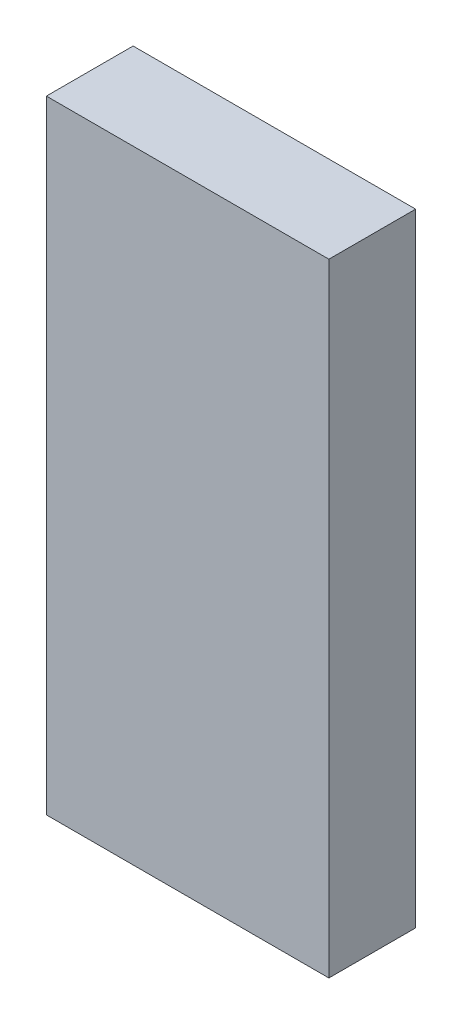
ISO-10303-21;
HEADER;
FILE_DESCRIPTION(('STEP AP214'),'2;1');
FILE_NAME('part.step','',(''),(''),'','','');
FILE_SCHEMA(('AUTOMOTIVE_DESIGN { 1 0 10303 214 1 1 1 1 }'));
ENDSEC;
DATA;
#1=APPLICATION_CONTEXT('core data for automotive mechanical design processes');
#2=APPLICATION_PROTOCOL_DEFINITION('international standard','automotive_design',2000,#1);
#3=PRODUCT_CONTEXT('',#1,'mechanical');
#4=PRODUCT('Part','Part','',(#3));
#5=PRODUCT_RELATED_PRODUCT_CATEGORY('part','',(#4));
#6=PRODUCT_DEFINITION_FORMATION('','',#4);
#7=PRODUCT_DEFINITION_CONTEXT('part definition',#1,'design');
#8=PRODUCT_DEFINITION('design','',#6,#7);
#9=PRODUCT_DEFINITION_SHAPE('','',#8);
#10=(LENGTH_UNIT() NAMED_UNIT(*) SI_UNIT(.MILLI.,.METRE.));
#11=(NAMED_UNIT(*) PLANE_ANGLE_UNIT() SI_UNIT($,.RADIAN.));
#12=(NAMED_UNIT(*) SI_UNIT($,.STERADIAN.) SOLID_ANGLE_UNIT());
#13=UNCERTAINTY_MEASURE_WITH_UNIT(LENGTH_MEASURE(1.E-05),#10,'distance_accuracy_value','');
#14=(GEOMETRIC_REPRESENTATION_CONTEXT(3) GLOBAL_UNCERTAINTY_ASSIGNED_CONTEXT((#13)) GLOBAL_UNIT_ASSIGNED_CONTEXT((#10,
#11,#12)) REPRESENTATION_CONTEXT('',''));
#15=CARTESIAN_POINT('',(0.,0.,0.));
#16=DIRECTION('',(0.,0.,1.));
#17=DIRECTION('',(1.,0.,0.));
#18=AXIS2_PLACEMENT_3D('',#15,#16,#17);
#19=CARTESIAN_POINT('',(-0.69209666,-1.52500076,0.42499788));
#20=DIRECTION('',(0.,0.,1.));
#21=DIRECTION('',(1.,0.,0.));
#22=AXIS2_PLACEMENT_3D('',#19,#20,#21);
#23=PLANE('',#22);
#24=DIRECTION('',(-1.66557432553136E-06,0.999999999998613,0.));
#25=VECTOR('',#24,1.);
#26=CARTESIAN_POINT('',(-0.69209666,-1.52500076,0.42499788));
#27=LINE('',#26,#25);
#28=CARTESIAN_POINT('',(-0.69209666,-1.52500076,0.42499788));
#29=VERTEX_POINT('',#28);
#30=CARTESIAN_POINT('',(-0.69210174,1.52499822,0.42499788));
#31=VERTEX_POINT('',#30);
#32=EDGE_CURVE('E91',#29,#31,#27,.T.);
#33=ORIENTED_EDGE('',*,*,#32,.F.);
#34=DIRECTION('',(-0.999999999998316,-1.83499369462658E-06,0.));
#35=VECTOR('',#34,1.);
#36=CARTESIAN_POINT('',(0.69210428,-1.52499822,0.42499788));
#37=LINE('',#36,#35);
#38=CARTESIAN_POINT('',(0.69210428,-1.52499822,0.42499788));
#39=VERTEX_POINT('',#38);
#40=EDGE_CURVE('E28',#39,#29,#37,.T.);
#41=ORIENTED_EDGE('',*,*,#40,.F.);
#42=DIRECTION('',(1.66557432553136E-06,-0.999999999998613,0.));
#43=VECTOR('',#42,1.);
#44=CARTESIAN_POINT('',(0.6920992,1.52500076,0.42499788));
#45=LINE('',#44,#43);
#46=CARTESIAN_POINT('',(0.6920992,1.52500076,0.42499788));
#47=VERTEX_POINT('',#46);
#48=EDGE_CURVE('E64',#47,#39,#45,.T.);
#49=ORIENTED_EDGE('',*,*,#48,.F.);
#50=DIRECTION('',(0.999999999998316,1.83499369462658E-06,0.));
#51=VECTOR('',#50,1.);
#52=CARTESIAN_POINT('',(-0.69210174,1.52499822,0.42499788));
#53=LINE('',#52,#51);
#54=EDGE_CURVE('E89',#31,#47,#53,.T.);
#55=ORIENTED_EDGE('',*,*,#54,.F.);
#56=EDGE_LOOP('',(#33,#41,#49,#55));
#57=FACE_BOUND('',#56,.T.);
#58=ADVANCED_FACE('F17',(#57),#23,.T.);
#59=CARTESIAN_POINT('',(-0.69209666,-1.52500076,0.));
#60=DIRECTION('',(0.,0.,1.));
#61=DIRECTION('',(1.,0.,0.));
#62=AXIS2_PLACEMENT_3D('',#59,#60,#61);
#63=PLANE('',#62);
#64=DIRECTION('',(-1.66557432553136E-06,0.999999999998613,0.));
#65=VECTOR('',#64,1.);
#66=CARTESIAN_POINT('',(-0.69209666,-1.52500076,0.));
#67=LINE('',#66,#65);
#68=CARTESIAN_POINT('',(-0.69209666,-1.52500076,0.));
#69=VERTEX_POINT('',#68);
#70=CARTESIAN_POINT('',(-0.69210174,1.52499822,0.));
#71=VERTEX_POINT('',#70);
#72=EDGE_CURVE('E21',#69,#71,#67,.T.);
#73=ORIENTED_EDGE('',*,*,#72,.T.);
#74=DIRECTION('',(0.999999999998316,1.83499369462658E-06,0.));
#75=VECTOR('',#74,1.);
#76=CARTESIAN_POINT('',(-0.69210174,1.52499822,0.));
#77=LINE('',#76,#75);
#78=CARTESIAN_POINT('',(0.6920992,1.52500076,0.));
#79=VERTEX_POINT('',#78);
#80=EDGE_CURVE('E103',#71,#79,#77,.T.);
#81=ORIENTED_EDGE('',*,*,#80,.T.);
#82=DIRECTION('',(1.66557432553136E-06,-0.999999999998613,0.));
#83=VECTOR('',#82,1.);
#84=CARTESIAN_POINT('',(0.6920992,1.52500076,0.));
#85=LINE('',#84,#83);
#86=CARTESIAN_POINT('',(0.69210428,-1.52499822,0.));
#87=VERTEX_POINT('',#86);
#88=EDGE_CURVE('E53',#79,#87,#85,.T.);
#89=ORIENTED_EDGE('',*,*,#88,.T.);
#90=DIRECTION('',(-0.999999999998316,-1.83499369462658E-06,0.));
#91=VECTOR('',#90,1.);
#92=CARTESIAN_POINT('',(0.69210428,-1.52499822,0.));
#93=LINE('',#92,#91);
#94=EDGE_CURVE('E11',#87,#69,#93,.T.);
#95=ORIENTED_EDGE('',*,*,#94,.T.);
#96=EDGE_LOOP('',(#73,#81,#89,#95));
#97=FACE_BOUND('',#96,.T.);
#98=ADVANCED_FACE('F79',(#97),#63,.F.);
#99=CARTESIAN_POINT('',(0.69210428,-1.52499822,0.));
#100=DIRECTION('',(1.83499369462658E-06,-0.999999999998316,0.));
#101=DIRECTION('',(0.,0.,-1.));
#102=AXIS2_PLACEMENT_3D('',#99,#100,#101);
#103=PLANE('',#102);
#104=DIRECTION('',(0.,0.,1.));
#105=VECTOR('',#104,1.);
#106=CARTESIAN_POINT('',(0.69210428,-1.52499822,0.));
#107=LINE('',#106,#105);
#108=EDGE_CURVE('E100',#87,#39,#107,.T.);
#109=ORIENTED_EDGE('',*,*,#108,.T.);
#110=ORIENTED_EDGE('',*,*,#40,.T.);
#111=DIRECTION('',(0.,0.,1.));
#112=VECTOR('',#111,1.);
#113=CARTESIAN_POINT('',(-0.69209666,-1.52500076,0.));
#114=LINE('',#113,#112);
#115=EDGE_CURVE('E85',#69,#29,#114,.T.);
#116=ORIENTED_EDGE('',*,*,#115,.F.);
#117=ORIENTED_EDGE('',*,*,#94,.F.);
#118=EDGE_LOOP('',(#109,#110,#116,#117));
#119=FACE_BOUND('',#118,.T.);
#120=ADVANCED_FACE('F19',(#119),#103,.T.);
#121=CARTESIAN_POINT('',(0.6920992,1.52500076,0.));
#122=DIRECTION('',(0.999999999998613,1.66557432553136E-06,0.));
#123=DIRECTION('',(0.,0.,-1.));
#124=AXIS2_PLACEMENT_3D('',#121,#122,#123);
#125=PLANE('',#124);
#126=DIRECTION('',(0.,0.,1.));
#127=VECTOR('',#126,1.);
#128=CARTESIAN_POINT('',(0.6920992,1.52500076,0.));
#129=LINE('',#128,#127);
#130=EDGE_CURVE('E106',#79,#47,#129,.T.);
#131=ORIENTED_EDGE('',*,*,#130,.T.);
#132=ORIENTED_EDGE('',*,*,#48,.T.);
#133=ORIENTED_EDGE('',*,*,#108,.F.);
#134=ORIENTED_EDGE('',*,*,#88,.F.);
#135=EDGE_LOOP('',(#131,#132,#133,#134));
#136=FACE_BOUND('',#135,.T.);
#137=ADVANCED_FACE('F119',(#136),#125,.T.);
#138=CARTESIAN_POINT('',(-0.69210174,1.52499822,0.));
#139=DIRECTION('',(-1.83499369462658E-06,0.999999999998316,0.));
#140=DIRECTION('',(0.,0.,1.));
#141=AXIS2_PLACEMENT_3D('',#138,#139,#140);
#142=PLANE('',#141);
#143=DIRECTION('',(0.,0.,1.));
#144=VECTOR('',#143,1.);
#145=CARTESIAN_POINT('',(-0.69210174,1.52499822,0.));
#146=LINE('',#145,#144);
#147=EDGE_CURVE('E87',#71,#31,#146,.T.);
#148=ORIENTED_EDGE('',*,*,#147,.T.);
#149=ORIENTED_EDGE('',*,*,#54,.T.);
#150=ORIENTED_EDGE('',*,*,#130,.F.);
#151=ORIENTED_EDGE('',*,*,#80,.F.);
#152=EDGE_LOOP('',(#148,#149,#150,#151));
#153=FACE_BOUND('',#152,.T.);
#154=ADVANCED_FACE('F122',(#153),#142,.T.);
#155=CARTESIAN_POINT('',(-0.69209666,-1.52500076,0.));
#156=DIRECTION('',(-0.999999999998613,-1.66557432553136E-06,0.));
#157=DIRECTION('',(-1.66557432553136E-06,0.999999999998613,0.));
#158=AXIS2_PLACEMENT_3D('',#155,#156,#157);
#159=PLANE('',#158);
#160=ORIENTED_EDGE('',*,*,#115,.T.);
#161=ORIENTED_EDGE('',*,*,#32,.T.);
#162=ORIENTED_EDGE('',*,*,#147,.F.);
#163=ORIENTED_EDGE('',*,*,#72,.F.);
#164=EDGE_LOOP('',(#160,#161,#162,#163));
#165=FACE_BOUND('',#164,.T.);
#166=ADVANCED_FACE('F83',(#165),#159,.T.);
#167=CLOSED_SHELL('',(#58,#98,#120,#137,#154,#166));
#168=MANIFOLD_SOLID_BREP('B1',#167);
#169=ADVANCED_BREP_SHAPE_REPRESENTATION('',(#18,#168),#14);
#170=SHAPE_DEFINITION_REPRESENTATION(#9,#169);
ENDSEC;
END-ISO-10303-21;
